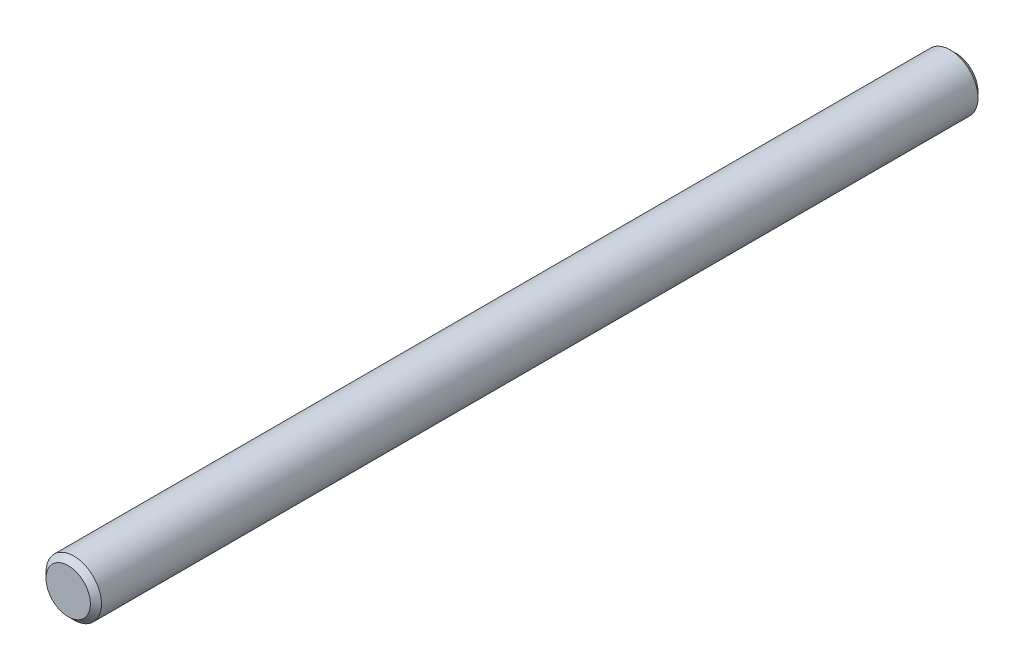
ISO-10303-21;
HEADER;
FILE_DESCRIPTION(('STEP AP214'),'2;1');
FILE_NAME('part.step','',(''),(''),'','','');
FILE_SCHEMA(('AUTOMOTIVE_DESIGN { 1 0 10303 214 1 1 1 1 }'));
ENDSEC;
DATA;
#1=APPLICATION_CONTEXT('core data for automotive mechanical design processes');
#2=APPLICATION_PROTOCOL_DEFINITION('international standard','automotive_design',2000,#1);
#3=PRODUCT_CONTEXT('',#1,'mechanical');
#4=PRODUCT('Part','Part','',(#3));
#5=PRODUCT_RELATED_PRODUCT_CATEGORY('part','',(#4));
#6=PRODUCT_DEFINITION_FORMATION('','',#4);
#7=PRODUCT_DEFINITION_CONTEXT('part definition',#1,'design');
#8=PRODUCT_DEFINITION('design','',#6,#7);
#9=PRODUCT_DEFINITION_SHAPE('','',#8);
#10=(LENGTH_UNIT() NAMED_UNIT(*) SI_UNIT(.MILLI.,.METRE.));
#11=(NAMED_UNIT(*) PLANE_ANGLE_UNIT() SI_UNIT($,.RADIAN.));
#12=(NAMED_UNIT(*) SI_UNIT($,.STERADIAN.) SOLID_ANGLE_UNIT());
#13=UNCERTAINTY_MEASURE_WITH_UNIT(LENGTH_MEASURE(1.E-05),#10,'distance_accuracy_value','');
#14=(GEOMETRIC_REPRESENTATION_CONTEXT(3) GLOBAL_UNCERTAINTY_ASSIGNED_CONTEXT((#13)) GLOBAL_UNIT_ASSIGNED_CONTEXT((#10,
#11,#12)) REPRESENTATION_CONTEXT('',''));
#15=CARTESIAN_POINT('',(0.,0.,0.));
#16=DIRECTION('',(0.,0.,1.));
#17=DIRECTION('',(1.,0.,0.));
#18=AXIS2_PLACEMENT_3D('',#15,#16,#17);
#19=CARTESIAN_POINT('',(0.,0.,152.4));
#20=DIRECTION('',(0.,0.,-1.));
#21=DIRECTION('',(-1.,0.,0.));
#22=AXIS2_PLACEMENT_3D('',#19,#20,#21);
#23=CYLINDRICAL_SURFACE('',#22,9.525);
#24=CARTESIAN_POINT('',(0.,0.,-150.495));
#25=DIRECTION('',(0.,0.,1.));
#26=DIRECTION('',(1.,0.,0.));
#27=AXIS2_PLACEMENT_3D('',#24,#25,#26);
#28=CIRCLE('',#27,9.525);
#29=CARTESIAN_POINT('',(9.525,0.,-150.495));
#30=VERTEX_POINT('',#29);
#31=EDGE_CURVE('E43',#30,#30,#28,.T.);
#32=ORIENTED_EDGE('',*,*,#31,.T.);
#33=EDGE_LOOP('',(#32));
#34=FACE_BOUND('',#33,.T.);
#35=CARTESIAN_POINT('',(0.,0.,150.495));
#36=DIRECTION('',(0.,0.,1.));
#37=DIRECTION('',(1.,0.,0.));
#38=AXIS2_PLACEMENT_3D('',#35,#36,#37);
#39=CIRCLE('',#38,9.525);
#40=CARTESIAN_POINT('',(9.525,0.,150.495));
#41=VERTEX_POINT('',#40);
#42=EDGE_CURVE('E47',#41,#41,#39,.F.);
#43=ORIENTED_EDGE('',*,*,#42,.T.);
#44=EDGE_LOOP('',(#43));
#45=FACE_BOUND('',#44,.T.);
#46=ADVANCED_FACE('F32',(#34,#45),#23,.T.);
#47=CARTESIAN_POINT('',(0.,0.,152.4));
#48=DIRECTION('',(0.,0.,1.));
#49=DIRECTION('',(1.,0.,0.));
#50=AXIS2_PLACEMENT_3D('',#47,#48,#49);
#51=PLANE('',#50);
#52=CARTESIAN_POINT('',(0.,0.,152.4));
#53=DIRECTION('',(0.,0.,1.));
#54=DIRECTION('',(1.,0.,0.));
#55=AXIS2_PLACEMENT_3D('',#52,#53,#54);
#56=CIRCLE('',#55,7.6200000000001);
#57=CARTESIAN_POINT('',(7.6200000000001,0.,152.4));
#58=VERTEX_POINT('',#57);
#59=EDGE_CURVE('E10',#58,#58,#56,.T.);
#60=ORIENTED_EDGE('',*,*,#59,.T.);
#61=EDGE_LOOP('',(#60));
#62=FACE_BOUND('',#61,.T.);
#63=ADVANCED_FACE('F63',(#62),#51,.T.);
#64=CARTESIAN_POINT('',(0.,0.,-152.4));
#65=DIRECTION('',(0.,0.,1.));
#66=DIRECTION('',(1.,0.,0.));
#67=AXIS2_PLACEMENT_3D('',#64,#65,#66);
#68=PLANE('',#67);
#69=CARTESIAN_POINT('',(0.,0.,-152.4));
#70=DIRECTION('',(0.,0.,1.));
#71=DIRECTION('',(1.,0.,0.));
#72=AXIS2_PLACEMENT_3D('',#69,#70,#71);
#73=CIRCLE('',#72,7.61999999999971);
#74=CARTESIAN_POINT('',(7.61999999999971,0.,-152.4));
#75=VERTEX_POINT('',#74);
#76=EDGE_CURVE('E39',#75,#75,#73,.F.);
#77=ORIENTED_EDGE('',*,*,#76,.T.);
#78=EDGE_LOOP('',(#77));
#79=FACE_BOUND('',#78,.T.);
#80=ADVANCED_FACE('F60',(#79),#68,.F.);
#81=CARTESIAN_POINT('',(0.,0.,-150.495));
#82=DIRECTION('',(0.,0.,1.));
#83=DIRECTION('',(1.,0.,0.));
#84=AXIS2_PLACEMENT_3D('',#81,#82,#83);
#85=CONICAL_SURFACE('',#84,9.525,0.78539816339744);
#86=ORIENTED_EDGE('',*,*,#76,.F.);
#87=EDGE_LOOP('',(#86));
#88=FACE_BOUND('',#87,.T.);
#89=ORIENTED_EDGE('',*,*,#31,.F.);
#90=EDGE_LOOP('',(#89));
#91=FACE_BOUND('',#90,.T.);
#92=ADVANCED_FACE('F56',(#88,#91),#85,.T.);
#93=CARTESIAN_POINT('',(0.,0.,152.4));
#94=DIRECTION('',(0.,0.,-1.));
#95=DIRECTION('',(-1.,0.,0.));
#96=AXIS2_PLACEMENT_3D('',#93,#94,#95);
#97=CONICAL_SURFACE('',#96,7.6200000000001,0.785398163397447);
#98=ORIENTED_EDGE('',*,*,#42,.F.);
#99=EDGE_LOOP('',(#98));
#100=FACE_BOUND('',#99,.T.);
#101=ORIENTED_EDGE('',*,*,#59,.F.);
#102=EDGE_LOOP('',(#101));
#103=FACE_BOUND('',#102,.T.);
#104=ADVANCED_FACE('F34',(#100,#103),#97,.T.);
#105=CLOSED_SHELL('',(#46,#63,#80,#92,#104));
#106=MANIFOLD_SOLID_BREP('B2',#105);
#107=ADVANCED_BREP_SHAPE_REPRESENTATION('',(#18,#106),#14);
#108=SHAPE_DEFINITION_REPRESENTATION(#9,#107);
ENDSEC;
END-ISO-10303-21;
